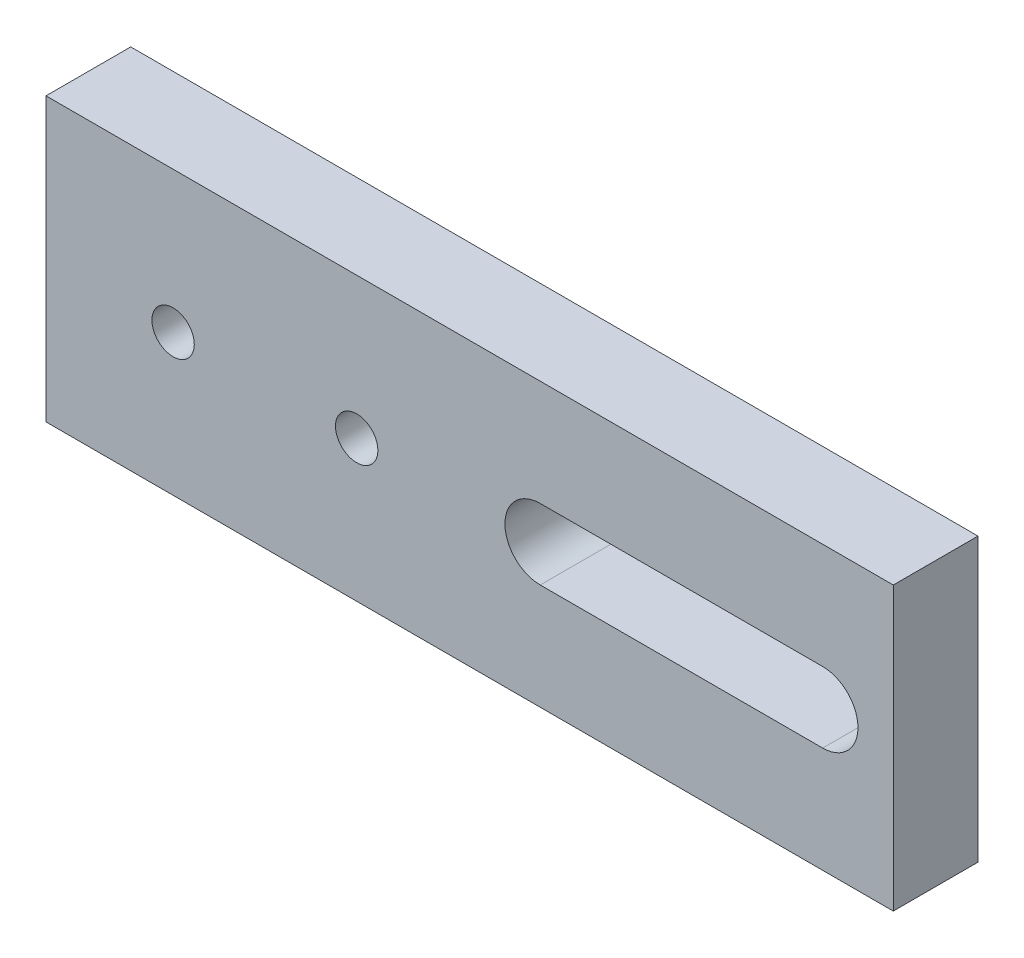
ISO-10303-21;
HEADER;
FILE_DESCRIPTION(('STEP AP214'),'2;1');
FILE_NAME('part.step','',(''),(''),'','','');
FILE_SCHEMA(('AUTOMOTIVE_DESIGN { 1 0 10303 214 1 1 1 1 }'));
ENDSEC;
DATA;
#1=APPLICATION_CONTEXT('core data for automotive mechanical design processes');
#2=APPLICATION_PROTOCOL_DEFINITION('international standard','automotive_design',2000,#1);
#3=PRODUCT_CONTEXT('',#1,'mechanical');
#4=PRODUCT('Part','Part','',(#3));
#5=PRODUCT_RELATED_PRODUCT_CATEGORY('part','',(#4));
#6=PRODUCT_DEFINITION_FORMATION('','',#4);
#7=PRODUCT_DEFINITION_CONTEXT('part definition',#1,'design');
#8=PRODUCT_DEFINITION('design','',#6,#7);
#9=PRODUCT_DEFINITION_SHAPE('','',#8);
#10=(LENGTH_UNIT() NAMED_UNIT(*) SI_UNIT(.MILLI.,.METRE.));
#11=(NAMED_UNIT(*) PLANE_ANGLE_UNIT() SI_UNIT($,.RADIAN.));
#12=(NAMED_UNIT(*) SI_UNIT($,.STERADIAN.) SOLID_ANGLE_UNIT());
#13=UNCERTAINTY_MEASURE_WITH_UNIT(LENGTH_MEASURE(1.E-05),#10,'distance_accuracy_value','');
#14=(GEOMETRIC_REPRESENTATION_CONTEXT(3) GLOBAL_UNCERTAINTY_ASSIGNED_CONTEXT((#13)) GLOBAL_UNIT_ASSIGNED_CONTEXT((#10,
#11,#12)) REPRESENTATION_CONTEXT('',''));
#15=CARTESIAN_POINT('',(0.,0.,0.));
#16=DIRECTION('',(0.,0.,1.));
#17=DIRECTION('',(1.,0.,0.));
#18=AXIS2_PLACEMENT_3D('',#15,#16,#17);
#19=CARTESIAN_POINT('',(0.,0.,6.));
#20=DIRECTION('',(0.,0.,-1.));
#21=DIRECTION('',(-1.,0.,0.));
#22=AXIS2_PLACEMENT_3D('',#19,#20,#21);
#23=PLANE('',#22);
#24=DIRECTION('',(0.,-1.,0.));
#25=VECTOR('',#24,1.);
#26=CARTESIAN_POINT('',(0.,0.,6.));
#27=LINE('',#26,#25);
#28=CARTESIAN_POINT('',(0.,20.,6.));
#29=VERTEX_POINT('',#28);
#30=CARTESIAN_POINT('',(0.,0.,6.));
#31=VERTEX_POINT('',#30);
#32=EDGE_CURVE('E156',#29,#31,#27,.T.);
#33=ORIENTED_EDGE('',*,*,#32,.T.);
#34=DIRECTION('',(1.,0.,0.));
#35=VECTOR('',#34,1.);
#36=CARTESIAN_POINT('',(0.,0.,6.));
#37=LINE('',#36,#35);
#38=CARTESIAN_POINT('',(60.,0.,6.));
#39=VERTEX_POINT('',#38);
#40=EDGE_CURVE('E160',#31,#39,#37,.T.);
#41=ORIENTED_EDGE('',*,*,#40,.T.);
#42=DIRECTION('',(0.,1.,0.));
#43=VECTOR('',#42,1.);
#44=CARTESIAN_POINT('',(60.,0.,6.));
#45=LINE('',#44,#43);
#46=CARTESIAN_POINT('',(60.,20.,6.));
#47=VERTEX_POINT('',#46);
#48=EDGE_CURVE('E164',#39,#47,#45,.T.);
#49=ORIENTED_EDGE('',*,*,#48,.T.);
#50=DIRECTION('',(-1.,0.,0.));
#51=VECTOR('',#50,1.);
#52=CARTESIAN_POINT('',(0.,20.,6.));
#53=LINE('',#52,#51);
#54=EDGE_CURVE('E167',#47,#29,#53,.T.);
#55=ORIENTED_EDGE('',*,*,#54,.T.);
#56=EDGE_LOOP('',(#33,#41,#49,#55));
#57=FACE_BOUND('',#56,.T.);
#58=CARTESIAN_POINT('',(35.,10.,6.));
#59=DIRECTION('',(0.,0.,1.));
#60=DIRECTION('',(1.,0.,0.));
#61=AXIS2_PLACEMENT_3D('',#58,#59,#60);
#62=CIRCLE('',#61,2.5);
#63=CARTESIAN_POINT('',(35.,12.5,6.));
#64=VERTEX_POINT('',#63);
#65=CARTESIAN_POINT('',(35.,7.5,6.));
#66=VERTEX_POINT('',#65);
#67=EDGE_CURVE('E105',#64,#66,#62,.T.);
#68=ORIENTED_EDGE('',*,*,#67,.F.);
#69=DIRECTION('',(-1.,0.,0.));
#70=VECTOR('',#69,1.);
#71=CARTESIAN_POINT('',(35.,12.5,6.));
#72=LINE('',#71,#70);
#73=CARTESIAN_POINT('',(55.,12.5,6.));
#74=VERTEX_POINT('',#73);
#75=EDGE_CURVE('E132',#74,#64,#72,.T.);
#76=ORIENTED_EDGE('',*,*,#75,.F.);
#77=CARTESIAN_POINT('',(55.,10.,6.));
#78=DIRECTION('',(0.,0.,1.));
#79=DIRECTION('',(1.,0.,0.));
#80=AXIS2_PLACEMENT_3D('',#77,#78,#79);
#81=CIRCLE('',#80,2.5);
#82=CARTESIAN_POINT('',(55.,7.5,6.));
#83=VERTEX_POINT('',#82);
#84=EDGE_CURVE('E128',#83,#74,#81,.T.);
#85=ORIENTED_EDGE('',*,*,#84,.F.);
#86=DIRECTION('',(1.,0.,0.));
#87=VECTOR('',#86,1.);
#88=CARTESIAN_POINT('',(35.,7.5,6.));
#89=LINE('',#88,#87);
#90=EDGE_CURVE('E114',#66,#83,#89,.T.);
#91=ORIENTED_EDGE('',*,*,#90,.F.);
#92=EDGE_LOOP('',(#68,#76,#85,#91));
#93=FACE_BOUND('',#92,.T.);
#94=CARTESIAN_POINT('',(22.,10.,6.));
#95=DIRECTION('',(0.,0.,1.));
#96=DIRECTION('',(1.,0.,0.));
#97=AXIS2_PLACEMENT_3D('',#94,#95,#96);
#98=CIRCLE('',#97,1.5);
#99=CARTESIAN_POINT('',(23.5,10.,6.));
#100=VERTEX_POINT('',#99);
#101=EDGE_CURVE('E140',#100,#100,#98,.T.);
#102=ORIENTED_EDGE('',*,*,#101,.F.);
#103=EDGE_LOOP('',(#102));
#104=FACE_BOUND('',#103,.T.);
#105=CARTESIAN_POINT('',(9.,10.,6.));
#106=DIRECTION('',(0.,0.,1.));
#107=DIRECTION('',(1.,0.,0.));
#108=AXIS2_PLACEMENT_3D('',#105,#106,#107);
#109=CIRCLE('',#108,1.5);
#110=CARTESIAN_POINT('',(10.5,10.,6.));
#111=VERTEX_POINT('',#110);
#112=EDGE_CURVE('E256',#111,#111,#109,.T.);
#113=ORIENTED_EDGE('',*,*,#112,.F.);
#114=EDGE_LOOP('',(#113));
#115=FACE_BOUND('',#114,.T.);
#116=ADVANCED_FACE('F39',(#57,#93,#104,#115),#23,.F.);
#117=CARTESIAN_POINT('',(0.,0.,0.));
#118=DIRECTION('',(0.,0.,-1.));
#119=DIRECTION('',(-1.,0.,0.));
#120=AXIS2_PLACEMENT_3D('',#117,#118,#119);
#121=PLANE('',#120);
#122=CARTESIAN_POINT('',(22.,10.,0.));
#123=DIRECTION('',(0.,0.,1.));
#124=DIRECTION('',(1.,0.,0.));
#125=AXIS2_PLACEMENT_3D('',#122,#123,#124);
#126=CIRCLE('',#125,1.5);
#127=CARTESIAN_POINT('',(23.5,10.,0.));
#128=VERTEX_POINT('',#127);
#129=EDGE_CURVE('E264',#128,#128,#126,.T.);
#130=ORIENTED_EDGE('',*,*,#129,.T.);
#131=EDGE_LOOP('',(#130));
#132=FACE_BOUND('',#131,.T.);
#133=DIRECTION('',(0.,-1.,0.));
#134=VECTOR('',#133,1.);
#135=CARTESIAN_POINT('',(0.,0.,0.));
#136=LINE('',#135,#134);
#137=CARTESIAN_POINT('',(0.,20.,0.));
#138=VERTEX_POINT('',#137);
#139=CARTESIAN_POINT('',(0.,0.,0.));
#140=VERTEX_POINT('',#139);
#141=EDGE_CURVE('E123',#138,#140,#136,.T.);
#142=ORIENTED_EDGE('',*,*,#141,.F.);
#143=DIRECTION('',(-1.,0.,0.));
#144=VECTOR('',#143,1.);
#145=CARTESIAN_POINT('',(0.,20.,0.));
#146=LINE('',#145,#144);
#147=CARTESIAN_POINT('',(60.,20.,0.));
#148=VERTEX_POINT('',#147);
#149=EDGE_CURVE('E161',#148,#138,#146,.T.);
#150=ORIENTED_EDGE('',*,*,#149,.F.);
#151=DIRECTION('',(0.,1.,0.));
#152=VECTOR('',#151,1.);
#153=CARTESIAN_POINT('',(60.,0.,0.));
#154=LINE('',#153,#152);
#155=CARTESIAN_POINT('',(60.,0.,0.));
#156=VERTEX_POINT('',#155);
#157=EDGE_CURVE('E177',#156,#148,#154,.T.);
#158=ORIENTED_EDGE('',*,*,#157,.F.);
#159=DIRECTION('',(1.,0.,0.));
#160=VECTOR('',#159,1.);
#161=CARTESIAN_POINT('',(0.,0.,0.));
#162=LINE('',#161,#160);
#163=EDGE_CURVE('E174',#140,#156,#162,.T.);
#164=ORIENTED_EDGE('',*,*,#163,.F.);
#165=EDGE_LOOP('',(#142,#150,#158,#164));
#166=FACE_BOUND('',#165,.T.);
#167=DIRECTION('',(-1.,0.,0.));
#168=VECTOR('',#167,1.);
#169=CARTESIAN_POINT('',(35.,12.5,0.));
#170=LINE('',#169,#168);
#171=CARTESIAN_POINT('',(55.,12.5,0.));
#172=VERTEX_POINT('',#171);
#173=CARTESIAN_POINT('',(35.,12.5,0.));
#174=VERTEX_POINT('',#173);
#175=EDGE_CURVE('E115',#172,#174,#170,.T.);
#176=ORIENTED_EDGE('',*,*,#175,.T.);
#177=CARTESIAN_POINT('',(35.,10.,0.));
#178=DIRECTION('',(0.,0.,1.));
#179=DIRECTION('',(1.,0.,0.));
#180=AXIS2_PLACEMENT_3D('',#177,#178,#179);
#181=CIRCLE('',#180,2.5);
#182=CARTESIAN_POINT('',(35.,7.5,0.));
#183=VERTEX_POINT('',#182);
#184=EDGE_CURVE('E63',#174,#183,#181,.T.);
#185=ORIENTED_EDGE('',*,*,#184,.T.);
#186=DIRECTION('',(1.,0.,0.));
#187=VECTOR('',#186,1.);
#188=CARTESIAN_POINT('',(35.,7.5,0.));
#189=LINE('',#188,#187);
#190=CARTESIAN_POINT('',(55.,7.5,0.));
#191=VERTEX_POINT('',#190);
#192=EDGE_CURVE('E121',#183,#191,#189,.T.);
#193=ORIENTED_EDGE('',*,*,#192,.T.);
#194=CARTESIAN_POINT('',(55.,10.,0.));
#195=DIRECTION('',(0.,0.,1.));
#196=DIRECTION('',(1.,0.,0.));
#197=AXIS2_PLACEMENT_3D('',#194,#195,#196);
#198=CIRCLE('',#197,2.5);
#199=EDGE_CURVE('E143',#191,#172,#198,.T.);
#200=ORIENTED_EDGE('',*,*,#199,.T.);
#201=EDGE_LOOP('',(#176,#185,#193,#200));
#202=FACE_BOUND('',#201,.T.);
#203=CARTESIAN_POINT('',(9.,10.,0.));
#204=DIRECTION('',(0.,0.,1.));
#205=DIRECTION('',(1.,0.,0.));
#206=AXIS2_PLACEMENT_3D('',#203,#204,#205);
#207=CIRCLE('',#206,1.5);
#208=CARTESIAN_POINT('',(10.5,10.,0.));
#209=VERTEX_POINT('',#208);
#210=EDGE_CURVE('E259',#209,#209,#207,.T.);
#211=ORIENTED_EDGE('',*,*,#210,.T.);
#212=EDGE_LOOP('',(#211));
#213=FACE_BOUND('',#212,.T.);
#214=ADVANCED_FACE('F200',(#132,#166,#202,#213),#121,.T.);
#215=CARTESIAN_POINT('',(0.,0.,6.));
#216=DIRECTION('',(1.,0.,0.));
#217=DIRECTION('',(0.,0.,-1.));
#218=AXIS2_PLACEMENT_3D('',#215,#216,#217);
#219=PLANE('',#218);
#220=ORIENTED_EDGE('',*,*,#141,.T.);
#221=DIRECTION('',(0.,0.,-1.));
#222=VECTOR('',#221,1.);
#223=CARTESIAN_POINT('',(0.,0.,6.));
#224=LINE('',#223,#222);
#225=EDGE_CURVE('E11',#31,#140,#224,.T.);
#226=ORIENTED_EDGE('',*,*,#225,.F.);
#227=ORIENTED_EDGE('',*,*,#32,.F.);
#228=DIRECTION('',(0.,0.,-1.));
#229=VECTOR('',#228,1.);
#230=CARTESIAN_POINT('',(0.,20.,6.));
#231=LINE('',#230,#229);
#232=EDGE_CURVE('E170',#29,#138,#231,.T.);
#233=ORIENTED_EDGE('',*,*,#232,.T.);
#234=EDGE_LOOP('',(#220,#226,#227,#233));
#235=FACE_BOUND('',#234,.T.);
#236=ADVANCED_FACE('F41',(#235),#219,.F.);
#237=CARTESIAN_POINT('',(0.,0.,6.));
#238=DIRECTION('',(0.,1.,0.));
#239=DIRECTION('',(0.,0.,1.));
#240=AXIS2_PLACEMENT_3D('',#237,#238,#239);
#241=PLANE('',#240);
#242=ORIENTED_EDGE('',*,*,#163,.T.);
#243=DIRECTION('',(0.,0.,-1.));
#244=VECTOR('',#243,1.);
#245=CARTESIAN_POINT('',(60.,0.,6.));
#246=LINE('',#245,#244);
#247=EDGE_CURVE('E48',#39,#156,#246,.T.);
#248=ORIENTED_EDGE('',*,*,#247,.F.);
#249=ORIENTED_EDGE('',*,*,#40,.F.);
#250=ORIENTED_EDGE('',*,*,#225,.T.);
#251=EDGE_LOOP('',(#242,#248,#249,#250));
#252=FACE_BOUND('',#251,.T.);
#253=ADVANCED_FACE('F210',(#252),#241,.F.);
#254=CARTESIAN_POINT('',(60.,0.,6.));
#255=DIRECTION('',(-1.,0.,0.));
#256=DIRECTION('',(0.,0.,1.));
#257=AXIS2_PLACEMENT_3D('',#254,#255,#256);
#258=PLANE('',#257);
#259=ORIENTED_EDGE('',*,*,#157,.T.);
#260=DIRECTION('',(0.,0.,-1.));
#261=VECTOR('',#260,1.);
#262=CARTESIAN_POINT('',(60.,20.,6.));
#263=LINE('',#262,#261);
#264=EDGE_CURVE('E185',#47,#148,#263,.T.);
#265=ORIENTED_EDGE('',*,*,#264,.F.);
#266=ORIENTED_EDGE('',*,*,#48,.F.);
#267=ORIENTED_EDGE('',*,*,#247,.T.);
#268=EDGE_LOOP('',(#259,#265,#266,#267));
#269=FACE_BOUND('',#268,.T.);
#270=ADVANCED_FACE('F194',(#269),#258,.F.);
#271=CARTESIAN_POINT('',(0.,20.,6.));
#272=DIRECTION('',(0.,-1.,0.));
#273=DIRECTION('',(0.,0.,-1.));
#274=AXIS2_PLACEMENT_3D('',#271,#272,#273);
#275=PLANE('',#274);
#276=ORIENTED_EDGE('',*,*,#149,.T.);
#277=ORIENTED_EDGE('',*,*,#232,.F.);
#278=ORIENTED_EDGE('',*,*,#54,.F.);
#279=ORIENTED_EDGE('',*,*,#264,.T.);
#280=EDGE_LOOP('',(#276,#277,#278,#279));
#281=FACE_BOUND('',#280,.T.);
#282=ADVANCED_FACE('F204',(#281),#275,.F.);
#283=CARTESIAN_POINT('',(35.,10.,6.));
#284=DIRECTION('',(0.,0.,-1.));
#285=DIRECTION('',(-1.,0.,0.));
#286=AXIS2_PLACEMENT_3D('',#283,#284,#285);
#287=CYLINDRICAL_SURFACE('',#286,2.5);
#288=ORIENTED_EDGE('',*,*,#184,.F.);
#289=DIRECTION('',(0.,0.,-1.));
#290=VECTOR('',#289,1.);
#291=CARTESIAN_POINT('',(35.,12.5,6.));
#292=LINE('',#291,#290);
#293=EDGE_CURVE('E109',#64,#174,#292,.T.);
#294=ORIENTED_EDGE('',*,*,#293,.F.);
#295=ORIENTED_EDGE('',*,*,#67,.T.);
#296=DIRECTION('',(0.,0.,-1.));
#297=VECTOR('',#296,1.);
#298=CARTESIAN_POINT('',(35.,7.5,6.));
#299=LINE('',#298,#297);
#300=EDGE_CURVE('E108',#66,#183,#299,.T.);
#301=ORIENTED_EDGE('',*,*,#300,.T.);
#302=EDGE_LOOP('',(#288,#294,#295,#301));
#303=FACE_BOUND('',#302,.T.);
#304=ADVANCED_FACE('F107',(#303),#287,.F.);
#305=CARTESIAN_POINT('',(35.,7.5,6.));
#306=DIRECTION('',(0.,1.,0.));
#307=DIRECTION('',(0.,0.,1.));
#308=AXIS2_PLACEMENT_3D('',#305,#306,#307);
#309=PLANE('',#308);
#310=ORIENTED_EDGE('',*,*,#192,.F.);
#311=ORIENTED_EDGE('',*,*,#300,.F.);
#312=ORIENTED_EDGE('',*,*,#90,.T.);
#313=DIRECTION('',(0.,0.,-1.));
#314=VECTOR('',#313,1.);
#315=CARTESIAN_POINT('',(55.,7.5,6.));
#316=LINE('',#315,#314);
#317=EDGE_CURVE('E124',#83,#191,#316,.T.);
#318=ORIENTED_EDGE('',*,*,#317,.T.);
#319=EDGE_LOOP('',(#310,#311,#312,#318));
#320=FACE_BOUND('',#319,.T.);
#321=ADVANCED_FACE('F118',(#320),#309,.T.);
#322=CARTESIAN_POINT('',(55.,10.,6.));
#323=DIRECTION('',(0.,0.,-1.));
#324=DIRECTION('',(-1.,0.,0.));
#325=AXIS2_PLACEMENT_3D('',#322,#323,#324);
#326=CYLINDRICAL_SURFACE('',#325,2.5);
#327=ORIENTED_EDGE('',*,*,#199,.F.);
#328=ORIENTED_EDGE('',*,*,#317,.F.);
#329=ORIENTED_EDGE('',*,*,#84,.T.);
#330=DIRECTION('',(0.,0.,-1.));
#331=VECTOR('',#330,1.);
#332=CARTESIAN_POINT('',(55.,12.5,6.));
#333=LINE('',#332,#331);
#334=EDGE_CURVE('E55',#74,#172,#333,.T.);
#335=ORIENTED_EDGE('',*,*,#334,.T.);
#336=EDGE_LOOP('',(#327,#328,#329,#335));
#337=FACE_BOUND('',#336,.T.);
#338=ADVANCED_FACE('F234',(#337),#326,.F.);
#339=CARTESIAN_POINT('',(35.,12.5,6.));
#340=DIRECTION('',(0.,-1.,0.));
#341=DIRECTION('',(0.,0.,-1.));
#342=AXIS2_PLACEMENT_3D('',#339,#340,#341);
#343=PLANE('',#342);
#344=ORIENTED_EDGE('',*,*,#175,.F.);
#345=ORIENTED_EDGE('',*,*,#334,.F.);
#346=ORIENTED_EDGE('',*,*,#75,.T.);
#347=ORIENTED_EDGE('',*,*,#293,.T.);
#348=EDGE_LOOP('',(#344,#345,#346,#347));
#349=FACE_BOUND('',#348,.T.);
#350=ADVANCED_FACE('F238',(#349),#343,.T.);
#351=CARTESIAN_POINT('',(22.,10.,6.));
#352=DIRECTION('',(0.,0.,-1.));
#353=DIRECTION('',(-1.,0.,0.));
#354=AXIS2_PLACEMENT_3D('',#351,#352,#353);
#355=CYLINDRICAL_SURFACE('',#354,1.5);
#356=ORIENTED_EDGE('',*,*,#101,.T.);
#357=EDGE_LOOP('',(#356));
#358=FACE_BOUND('',#357,.T.);
#359=ORIENTED_EDGE('',*,*,#129,.F.);
#360=EDGE_LOOP('',(#359));
#361=FACE_BOUND('',#360,.T.);
#362=ADVANCED_FACE('F244',(#358,#361),#355,.F.);
#363=CARTESIAN_POINT('',(9.,10.,6.));
#364=DIRECTION('',(0.,0.,-1.));
#365=DIRECTION('',(-1.,0.,0.));
#366=AXIS2_PLACEMENT_3D('',#363,#364,#365);
#367=CYLINDRICAL_SURFACE('',#366,1.5);
#368=ORIENTED_EDGE('',*,*,#112,.T.);
#369=EDGE_LOOP('',(#368));
#370=FACE_BOUND('',#369,.T.);
#371=ORIENTED_EDGE('',*,*,#210,.F.);
#372=EDGE_LOOP('',(#371));
#373=FACE_BOUND('',#372,.T.);
#374=ADVANCED_FACE('F247',(#370,#373),#367,.F.);
#375=CLOSED_SHELL('',(#116,#214,#236,#253,#270,#282,#304,#321,#338,#350,#362,#374));
#376=MANIFOLD_SOLID_BREP('B2',#375);
#377=ADVANCED_BREP_SHAPE_REPRESENTATION('',(#18,#376),#14);
#378=SHAPE_DEFINITION_REPRESENTATION(#9,#377);
ENDSEC;
END-ISO-10303-21;
